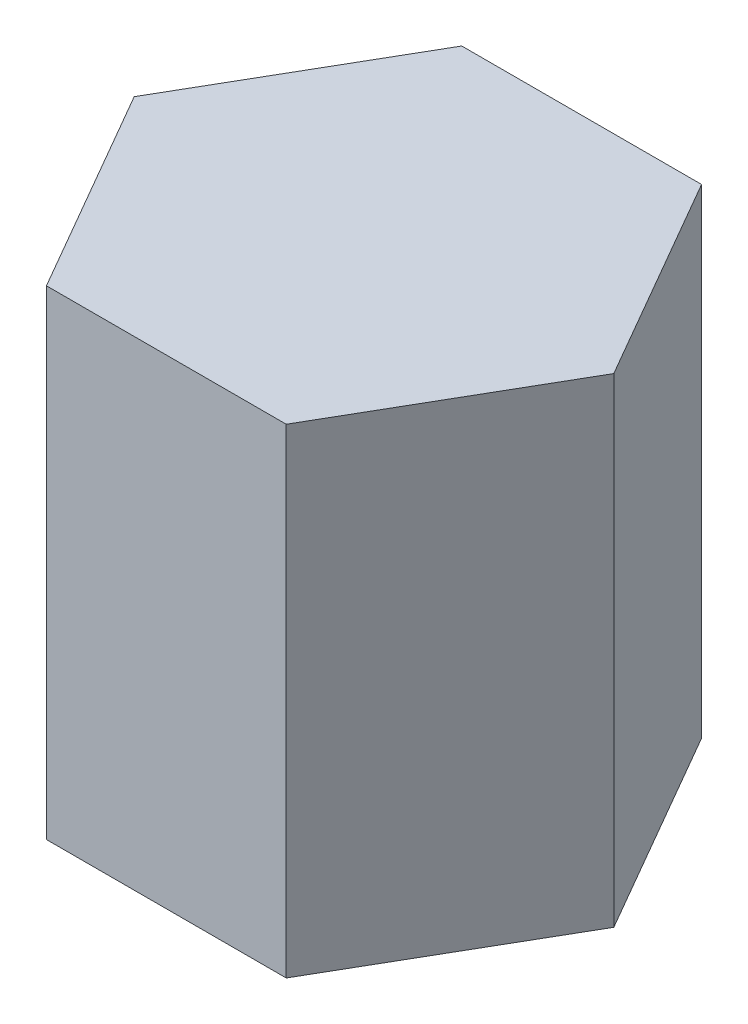
ISO-10303-21;
HEADER;
FILE_DESCRIPTION(('STEP AP214'),'2;1');
FILE_NAME('part.step','',(''),(''),'','','');
FILE_SCHEMA(('AUTOMOTIVE_DESIGN { 1 0 10303 214 1 1 1 1 }'));
ENDSEC;
DATA;
#1=APPLICATION_CONTEXT('core data for automotive mechanical design processes');
#2=APPLICATION_PROTOCOL_DEFINITION('international standard','automotive_design',2000,#1);
#3=PRODUCT_CONTEXT('',#1,'mechanical');
#4=PRODUCT('Part','Part','',(#3));
#5=PRODUCT_RELATED_PRODUCT_CATEGORY('part','',(#4));
#6=PRODUCT_DEFINITION_FORMATION('','',#4);
#7=PRODUCT_DEFINITION_CONTEXT('part definition',#1,'design');
#8=PRODUCT_DEFINITION('design','',#6,#7);
#9=PRODUCT_DEFINITION_SHAPE('','',#8);
#10=(LENGTH_UNIT() NAMED_UNIT(*) SI_UNIT(.MILLI.,.METRE.));
#11=(NAMED_UNIT(*) PLANE_ANGLE_UNIT() SI_UNIT($,.RADIAN.));
#12=(NAMED_UNIT(*) SI_UNIT($,.STERADIAN.) SOLID_ANGLE_UNIT());
#13=UNCERTAINTY_MEASURE_WITH_UNIT(LENGTH_MEASURE(1.E-05),#10,'distance_accuracy_value','');
#14=(GEOMETRIC_REPRESENTATION_CONTEXT(3) GLOBAL_UNCERTAINTY_ASSIGNED_CONTEXT((#13)) GLOBAL_UNIT_ASSIGNED_CONTEXT((#10,
#11,#12)) REPRESENTATION_CONTEXT('',''));
#15=CARTESIAN_POINT('',(0.,0.,0.));
#16=DIRECTION('',(0.,0.,1.));
#17=DIRECTION('',(1.,0.,0.));
#18=AXIS2_PLACEMENT_3D('',#15,#16,#17);
#19=CARTESIAN_POINT('',(-1.03853015596955E-13,50.8,-43.9940905122496));
#20=DIRECTION('',(0.,0.,1.));
#21=DIRECTION('',(1.,0.,0.));
#22=AXIS2_PLACEMENT_3D('',#19,#20,#21);
#23=PLANE('',#22);
#24=DIRECTION('',(-1.,0.,0.));
#25=VECTOR('',#24,1.);
#26=CARTESIAN_POINT('',(-1.03853015596955E-13,0.,-43.9940905122496));
#27=LINE('',#26,#25);
#28=CARTESIAN_POINT('',(-1.03853015596955E-13,0.,-43.9940905122496));
#29=VERTEX_POINT('',#28);
#30=CARTESIAN_POINT('',(-25.4,0.,-43.9940905122496));
#31=VERTEX_POINT('',#30);
#32=EDGE_CURVE('E117',#29,#31,#27,.T.);
#33=ORIENTED_EDGE('',*,*,#32,.T.);
#34=DIRECTION('',(0.,-1.,0.));
#35=VECTOR('',#34,1.);
#36=CARTESIAN_POINT('',(-25.4,50.8,-43.9940905122496));
#37=LINE('',#36,#35);
#38=CARTESIAN_POINT('',(-25.4,50.8,-43.9940905122496));
#39=VERTEX_POINT('',#38);
#40=EDGE_CURVE('E11',#39,#31,#37,.T.);
#41=ORIENTED_EDGE('',*,*,#40,.F.);
#42=DIRECTION('',(-1.,0.,0.));
#43=VECTOR('',#42,1.);
#44=CARTESIAN_POINT('',(-1.03853015596955E-13,50.8,-43.9940905122496));
#45=LINE('',#44,#43);
#46=CARTESIAN_POINT('',(-1.03853015596955E-13,50.8,-43.9940905122496));
#47=VERTEX_POINT('',#46);
#48=EDGE_CURVE('E130',#47,#39,#45,.T.);
#49=ORIENTED_EDGE('',*,*,#48,.F.);
#50=DIRECTION('',(0.,-1.,0.));
#51=VECTOR('',#50,1.);
#52=CARTESIAN_POINT('',(-1.03853015596955E-13,50.8,-43.9940905122496));
#53=LINE('',#52,#51);
#54=EDGE_CURVE('E48',#47,#29,#53,.T.);
#55=ORIENTED_EDGE('',*,*,#54,.T.);
#56=EDGE_LOOP('',(#33,#41,#49,#55));
#57=FACE_BOUND('',#56,.T.);
#58=ADVANCED_FACE('F32',(#57),#23,.F.);
#59=CARTESIAN_POINT('',(-25.4,50.8,-43.9940905122496));
#60=DIRECTION('',(0.866025403784437,0.,0.500000000000003));
#61=DIRECTION('',(0.500000000000003,0.,-0.866025403784437));
#62=AXIS2_PLACEMENT_3D('',#59,#60,#61);
#63=PLANE('',#62);
#64=DIRECTION('',(-0.500000000000003,0.,0.866025403784437));
#65=VECTOR('',#64,1.);
#66=CARTESIAN_POINT('',(-25.4,0.,-43.9940905122496));
#67=LINE('',#66,#65);
#68=CARTESIAN_POINT('',(-38.1000000000001,0.,-21.9970452561248));
#69=VERTEX_POINT('',#68);
#70=EDGE_CURVE('E119',#31,#69,#67,.T.);
#71=ORIENTED_EDGE('',*,*,#70,.T.);
#72=DIRECTION('',(0.,-1.,0.));
#73=VECTOR('',#72,1.);
#74=CARTESIAN_POINT('',(-38.1000000000001,50.8,-21.9970452561248));
#75=LINE('',#74,#73);
#76=CARTESIAN_POINT('',(-38.1000000000001,50.8,-21.9970452561248));
#77=VERTEX_POINT('',#76);
#78=EDGE_CURVE('E40',#77,#69,#75,.T.);
#79=ORIENTED_EDGE('',*,*,#78,.F.);
#80=DIRECTION('',(-0.500000000000003,0.,0.866025403784437));
#81=VECTOR('',#80,1.);
#82=CARTESIAN_POINT('',(-25.4,50.8,-43.9940905122496));
#83=LINE('',#82,#81);
#84=EDGE_CURVE('E81',#39,#77,#83,.T.);
#85=ORIENTED_EDGE('',*,*,#84,.F.);
#86=ORIENTED_EDGE('',*,*,#40,.T.);
#87=EDGE_LOOP('',(#71,#79,#85,#86));
#88=FACE_BOUND('',#87,.T.);
#89=ADVANCED_FACE('F150',(#88),#63,.F.);
#90=CARTESIAN_POINT('',(-38.1000000000001,50.8,-21.9970452561248));
#91=DIRECTION('',(0.866025403784437,0.,-0.500000000000002));
#92=DIRECTION('',(-0.500000000000002,0.,-0.866025403784438));
#93=AXIS2_PLACEMENT_3D('',#90,#91,#92);
#94=PLANE('',#93);
#95=DIRECTION('',(0.500000000000002,0.,0.866025403784437));
#96=VECTOR('',#95,1.);
#97=CARTESIAN_POINT('',(-38.1000000000001,0.,-21.9970452561248));
#98=LINE('',#97,#96);
#99=CARTESIAN_POINT('',(-25.4,0.,0.));
#100=VERTEX_POINT('',#99);
#101=EDGE_CURVE('E121',#69,#100,#98,.T.);
#102=ORIENTED_EDGE('',*,*,#101,.T.);
#103=DIRECTION('',(0.,-1.,0.));
#104=VECTOR('',#103,1.);
#105=CARTESIAN_POINT('',(-25.4,50.8,0.));
#106=LINE('',#105,#104);
#107=CARTESIAN_POINT('',(-25.4,50.8,0.));
#108=VERTEX_POINT('',#107);
#109=EDGE_CURVE('E100',#108,#100,#106,.T.);
#110=ORIENTED_EDGE('',*,*,#109,.F.);
#111=DIRECTION('',(0.500000000000002,0.,0.866025403784437));
#112=VECTOR('',#111,1.);
#113=CARTESIAN_POINT('',(-38.1000000000001,50.8,-21.9970452561248));
#114=LINE('',#113,#112);
#115=EDGE_CURVE('E110',#77,#108,#114,.T.);
#116=ORIENTED_EDGE('',*,*,#115,.F.);
#117=ORIENTED_EDGE('',*,*,#78,.T.);
#118=EDGE_LOOP('',(#102,#110,#116,#117));
#119=FACE_BOUND('',#118,.T.);
#120=ADVANCED_FACE('F136',(#119),#94,.F.);
#121=CARTESIAN_POINT('',(0.,50.8,0.));
#122=DIRECTION('',(0.,0.,1.));
#123=DIRECTION('',(1.,0.,0.));
#124=AXIS2_PLACEMENT_3D('',#121,#122,#123);
#125=PLANE('',#124);
#126=DIRECTION('',(-1.,0.,0.));
#127=VECTOR('',#126,1.);
#128=CARTESIAN_POINT('',(0.,0.,0.));
#129=LINE('',#128,#127);
#130=CARTESIAN_POINT('',(0.,0.,0.));
#131=VERTEX_POINT('',#130);
#132=EDGE_CURVE('E97',#131,#100,#129,.T.);
#133=ORIENTED_EDGE('',*,*,#132,.F.);
#134=DIRECTION('',(0.,-1.,0.));
#135=VECTOR('',#134,1.);
#136=CARTESIAN_POINT('',(0.,50.8,0.));
#137=LINE('',#136,#135);
#138=CARTESIAN_POINT('',(0.,50.8,0.));
#139=VERTEX_POINT('',#138);
#140=EDGE_CURVE('E91',#139,#131,#137,.T.);
#141=ORIENTED_EDGE('',*,*,#140,.F.);
#142=DIRECTION('',(-1.,0.,0.));
#143=VECTOR('',#142,1.);
#144=CARTESIAN_POINT('',(0.,50.8,0.));
#145=LINE('',#144,#143);
#146=EDGE_CURVE('E95',#139,#108,#145,.T.);
#147=ORIENTED_EDGE('',*,*,#146,.T.);
#148=ORIENTED_EDGE('',*,*,#109,.T.);
#149=EDGE_LOOP('',(#133,#141,#147,#148));
#150=FACE_BOUND('',#149,.T.);
#151=ADVANCED_FACE('F93',(#150),#125,.T.);
#152=CARTESIAN_POINT('',(0.,50.8,0.));
#153=DIRECTION('',(-0.86602540378444,0.,-0.499999999999998));
#154=DIRECTION('',(-0.499999999999998,0.,0.86602540378444));
#155=AXIS2_PLACEMENT_3D('',#152,#153,#154);
#156=PLANE('',#155);
#157=DIRECTION('',(0.499999999999998,0.,-0.86602540378444));
#158=VECTOR('',#157,1.);
#159=CARTESIAN_POINT('',(0.,0.,0.));
#160=LINE('',#159,#158);
#161=CARTESIAN_POINT('',(12.6999999999999,0.,-21.9970452561248));
#162=VERTEX_POINT('',#161);
#163=EDGE_CURVE('E125',#131,#162,#160,.T.);
#164=ORIENTED_EDGE('',*,*,#163,.T.);
#165=DIRECTION('',(0.,-1.,0.));
#166=VECTOR('',#165,1.);
#167=CARTESIAN_POINT('',(12.6999999999999,50.8,-21.9970452561248));
#168=LINE('',#167,#166);
#169=CARTESIAN_POINT('',(12.6999999999999,50.8,-21.9970452561248));
#170=VERTEX_POINT('',#169);
#171=EDGE_CURVE('E69',#170,#162,#168,.T.);
#172=ORIENTED_EDGE('',*,*,#171,.F.);
#173=DIRECTION('',(0.499999999999998,0.,-0.86602540378444));
#174=VECTOR('',#173,1.);
#175=CARTESIAN_POINT('',(0.,50.8,0.));
#176=LINE('',#175,#174);
#177=EDGE_CURVE('E102',#139,#170,#176,.T.);
#178=ORIENTED_EDGE('',*,*,#177,.F.);
#179=ORIENTED_EDGE('',*,*,#140,.T.);
#180=EDGE_LOOP('',(#164,#172,#178,#179));
#181=FACE_BOUND('',#180,.T.);
#182=ADVANCED_FACE('F103',(#181),#156,.F.);
#183=CARTESIAN_POINT('',(-1.03853015596955E-13,50.8,-43.9940905122496));
#184=DIRECTION('',(0.866025403784438,0.,-0.500000000000001));
#185=DIRECTION('',(-0.500000000000001,0.,-0.866025403784438));
#186=AXIS2_PLACEMENT_3D('',#183,#184,#185);
#187=PLANE('',#186);
#188=DIRECTION('',(0.500000000000001,0.,0.866025403784438));
#189=VECTOR('',#188,1.);
#190=CARTESIAN_POINT('',(-1.03853015596955E-13,0.,-43.9940905122496));
#191=LINE('',#190,#189);
#192=EDGE_CURVE('E127',#29,#162,#191,.T.);
#193=ORIENTED_EDGE('',*,*,#192,.F.);
#194=ORIENTED_EDGE('',*,*,#54,.F.);
#195=DIRECTION('',(0.500000000000001,0.,0.866025403784438));
#196=VECTOR('',#195,1.);
#197=CARTESIAN_POINT('',(-1.03853015596955E-13,50.8,-43.9940905122496));
#198=LINE('',#197,#196);
#199=EDGE_CURVE('E106',#47,#170,#198,.T.);
#200=ORIENTED_EDGE('',*,*,#199,.T.);
#201=ORIENTED_EDGE('',*,*,#171,.T.);
#202=EDGE_LOOP('',(#193,#194,#200,#201));
#203=FACE_BOUND('',#202,.T.);
#204=ADVANCED_FACE('F139',(#203),#187,.T.);
#205=CARTESIAN_POINT('',(0.,50.8,0.));
#206=DIRECTION('',(0.,1.,0.));
#207=DIRECTION('',(0.,0.,1.));
#208=AXIS2_PLACEMENT_3D('',#205,#206,#207);
#209=PLANE('',#208);
#210=ORIENTED_EDGE('',*,*,#48,.T.);
#211=ORIENTED_EDGE('',*,*,#84,.T.);
#212=ORIENTED_EDGE('',*,*,#115,.T.);
#213=ORIENTED_EDGE('',*,*,#146,.F.);
#214=ORIENTED_EDGE('',*,*,#177,.T.);
#215=ORIENTED_EDGE('',*,*,#199,.F.);
#216=EDGE_LOOP('',(#210,#211,#212,#213,#214,#215));
#217=FACE_BOUND('',#216,.T.);
#218=ADVANCED_FACE('F108',(#217),#209,.T.);
#219=CARTESIAN_POINT('',(0.,0.,0.));
#220=DIRECTION('',(0.,1.,0.));
#221=DIRECTION('',(0.,0.,1.));
#222=AXIS2_PLACEMENT_3D('',#219,#220,#221);
#223=PLANE('',#222);
#224=ORIENTED_EDGE('',*,*,#32,.F.);
#225=ORIENTED_EDGE('',*,*,#192,.T.);
#226=ORIENTED_EDGE('',*,*,#163,.F.);
#227=ORIENTED_EDGE('',*,*,#132,.T.);
#228=ORIENTED_EDGE('',*,*,#101,.F.);
#229=ORIENTED_EDGE('',*,*,#70,.F.);
#230=EDGE_LOOP('',(#224,#225,#226,#227,#228,#229));
#231=FACE_BOUND('',#230,.T.);
#232=ADVANCED_FACE('F138',(#231),#223,.F.);
#233=CLOSED_SHELL('',(#58,#89,#120,#151,#182,#204,#218,#232));
#234=MANIFOLD_SOLID_BREP('B2',#233);
#235=ADVANCED_BREP_SHAPE_REPRESENTATION('',(#18,#234),#14);
#236=SHAPE_DEFINITION_REPRESENTATION(#9,#235);
ENDSEC;
END-ISO-10303-21;
